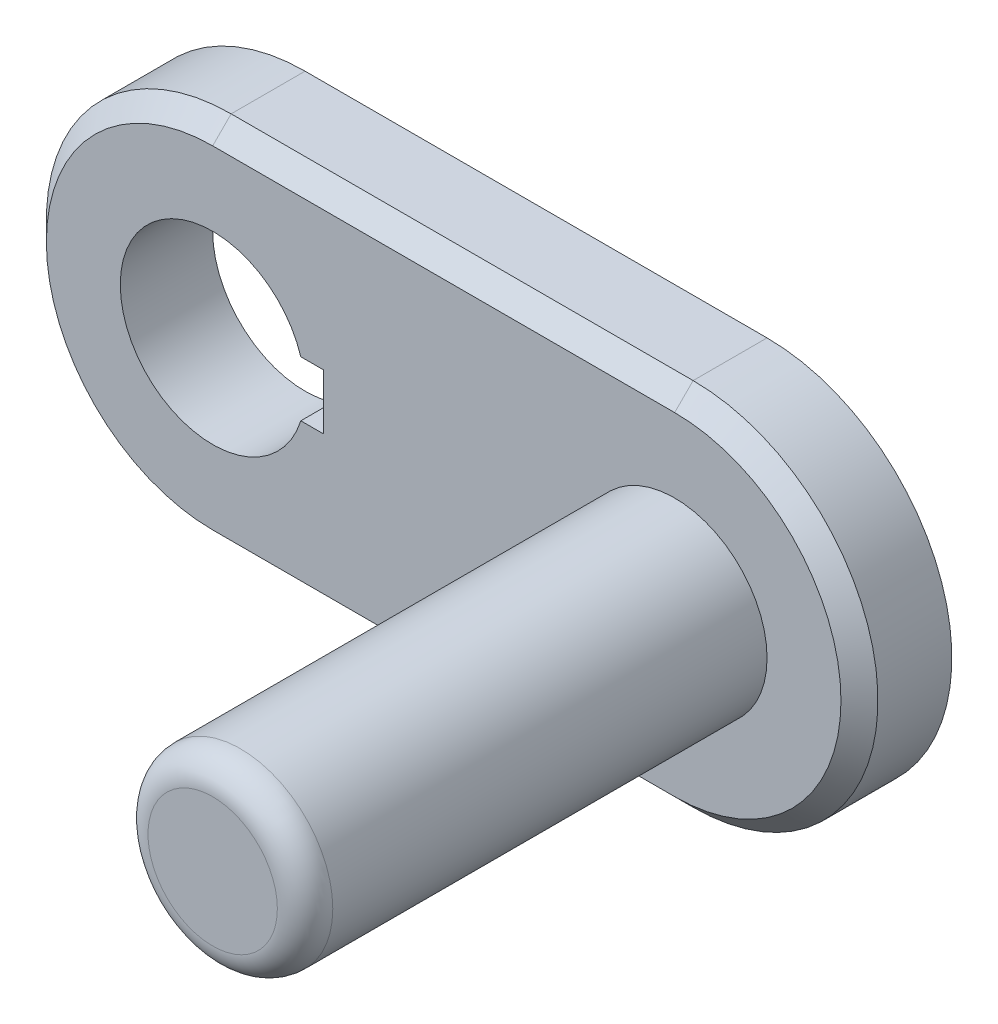
ISO-10303-21;
HEADER;
FILE_DESCRIPTION(('STEP AP214'),'2;1');
FILE_NAME('part.step','',(''),(''),'','','');
FILE_SCHEMA(('AUTOMOTIVE_DESIGN { 1 0 10303 214 1 1 1 1 }'));
ENDSEC;
DATA;
#1=APPLICATION_CONTEXT('core data for automotive mechanical design processes');
#2=APPLICATION_PROTOCOL_DEFINITION('international standard','automotive_design',2000,#1);
#3=PRODUCT_CONTEXT('',#1,'mechanical');
#4=PRODUCT('Part','Part','',(#3));
#5=PRODUCT_RELATED_PRODUCT_CATEGORY('part','',(#4));
#6=PRODUCT_DEFINITION_FORMATION('','',#4);
#7=PRODUCT_DEFINITION_CONTEXT('part definition',#1,'design');
#8=PRODUCT_DEFINITION('design','',#6,#7);
#9=PRODUCT_DEFINITION_SHAPE('','',#8);
#10=(LENGTH_UNIT() NAMED_UNIT(*) SI_UNIT(.MILLI.,.METRE.));
#11=(NAMED_UNIT(*) PLANE_ANGLE_UNIT() SI_UNIT($,.RADIAN.));
#12=(NAMED_UNIT(*) SI_UNIT($,.STERADIAN.) SOLID_ANGLE_UNIT());
#13=UNCERTAINTY_MEASURE_WITH_UNIT(LENGTH_MEASURE(1.E-05),#10,'distance_accuracy_value','');
#14=(GEOMETRIC_REPRESENTATION_CONTEXT(3) GLOBAL_UNCERTAINTY_ASSIGNED_CONTEXT((#13)) GLOBAL_UNIT_ASSIGNED_CONTEXT((#10,
#11,#12)) REPRESENTATION_CONTEXT('',''));
#15=CARTESIAN_POINT('',(0.,0.,0.));
#16=DIRECTION('',(0.,0.,1.));
#17=DIRECTION('',(1.,0.,0.));
#18=AXIS2_PLACEMENT_3D('',#15,#16,#17);
#19=CARTESIAN_POINT('',(0.,0.,10.));
#20=DIRECTION('',(0.,0.,1.));
#21=DIRECTION('',(1.,0.,0.));
#22=AXIS2_PLACEMENT_3D('',#19,#20,#21);
#23=PLANE('',#22);
#24=DIRECTION('',(1.,0.,0.));
#25=VECTOR('',#24,1.);
#26=CARTESIAN_POINT('',(50.,-18.,10.));
#27=LINE('',#26,#25);
#28=CARTESIAN_POINT('',(0.,-18.,10.));
#29=VERTEX_POINT('',#28);
#30=CARTESIAN_POINT('',(50.,-18.,10.));
#31=VERTEX_POINT('',#30);
#32=EDGE_CURVE('E181',#29,#31,#27,.T.);
#33=ORIENTED_EDGE('',*,*,#32,.T.);
#34=CARTESIAN_POINT('',(50.,0.,10.));
#35=DIRECTION('',(0.,0.,1.));
#36=DIRECTION('',(1.,0.,0.));
#37=AXIS2_PLACEMENT_3D('',#34,#35,#36);
#38=CIRCLE('',#37,18.);
#39=CARTESIAN_POINT('',(50.,18.,10.));
#40=VERTEX_POINT('',#39);
#41=EDGE_CURVE('E187',#31,#40,#38,.T.);
#42=ORIENTED_EDGE('',*,*,#41,.T.);
#43=DIRECTION('',(-1.,0.,0.));
#44=VECTOR('',#43,1.);
#45=CARTESIAN_POINT('',(0.,18.,10.));
#46=LINE('',#45,#44);
#47=CARTESIAN_POINT('',(0.,18.,10.));
#48=VERTEX_POINT('',#47);
#49=EDGE_CURVE('E185',#40,#48,#46,.T.);
#50=ORIENTED_EDGE('',*,*,#49,.T.);
#51=CARTESIAN_POINT('',(0.,0.,10.));
#52=DIRECTION('',(0.,0.,1.));
#53=DIRECTION('',(1.,0.,0.));
#54=AXIS2_PLACEMENT_3D('',#51,#52,#53);
#55=CIRCLE('',#54,18.);
#56=EDGE_CURVE('E183',#48,#29,#55,.T.);
#57=ORIENTED_EDGE('',*,*,#56,.T.);
#58=EDGE_LOOP('',(#33,#42,#50,#57));
#59=FACE_BOUND('',#58,.T.);
#60=CARTESIAN_POINT('',(50.,0.,10.));
#61=DIRECTION('',(0.,0.,1.));
#62=DIRECTION('',(1.,0.,0.));
#63=AXIS2_PLACEMENT_3D('',#60,#61,#62);
#64=CIRCLE('',#63,10.);
#65=CARTESIAN_POINT('',(60.,0.,10.));
#66=VERTEX_POINT('',#65);
#67=EDGE_CURVE('E145',#66,#66,#64,.T.);
#68=ORIENTED_EDGE('',*,*,#67,.F.);
#69=EDGE_LOOP('',(#68));
#70=FACE_BOUND('',#69,.T.);
#71=DIRECTION('',(1.,0.,0.));
#72=VECTOR('',#71,1.);
#73=CARTESIAN_POINT('',(9.53939201416946,-3.,10.));
#74=LINE('',#73,#72);
#75=CARTESIAN_POINT('',(9.53939201416946,-3.,10.));
#76=VERTEX_POINT('',#75);
#77=CARTESIAN_POINT('',(12.,-3.,10.));
#78=VERTEX_POINT('',#77);
#79=EDGE_CURVE('E123',#76,#78,#74,.T.);
#80=ORIENTED_EDGE('',*,*,#79,.F.);
#81=CARTESIAN_POINT('',(0.,0.,10.));
#82=DIRECTION('',(0.,0.,1.));
#83=DIRECTION('',(1.,0.,0.));
#84=AXIS2_PLACEMENT_3D('',#81,#82,#83);
#85=CIRCLE('',#84,10.);
#86=CARTESIAN_POINT('',(9.53939201416946,3.,10.));
#87=VERTEX_POINT('',#86);
#88=EDGE_CURVE('E113',#87,#76,#85,.T.);
#89=ORIENTED_EDGE('',*,*,#88,.F.);
#90=DIRECTION('',(-1.,0.,0.));
#91=VECTOR('',#90,1.);
#92=CARTESIAN_POINT('',(9.53939201416946,3.,10.));
#93=LINE('',#92,#91);
#94=CARTESIAN_POINT('',(12.,3.,10.));
#95=VERTEX_POINT('',#94);
#96=EDGE_CURVE('E138',#95,#87,#93,.T.);
#97=ORIENTED_EDGE('',*,*,#96,.F.);
#98=DIRECTION('',(0.,1.,0.));
#99=VECTOR('',#98,1.);
#100=CARTESIAN_POINT('',(12.,3.,10.));
#101=LINE('',#100,#99);
#102=EDGE_CURVE('E136',#78,#95,#101,.T.);
#103=ORIENTED_EDGE('',*,*,#102,.F.);
#104=EDGE_LOOP('',(#80,#89,#97,#103));
#105=FACE_BOUND('',#104,.T.);
#106=ADVANCED_FACE('F35',(#59,#70,#105),#23,.T.);
#107=CARTESIAN_POINT('',(0.,0.,0.));
#108=DIRECTION('',(0.,0.,1.));
#109=DIRECTION('',(1.,0.,0.));
#110=AXIS2_PLACEMENT_3D('',#107,#108,#109);
#111=PLANE('',#110);
#112=CARTESIAN_POINT('',(0.,0.,0.));
#113=DIRECTION('',(0.,0.,1.));
#114=DIRECTION('',(1.,0.,0.));
#115=AXIS2_PLACEMENT_3D('',#112,#113,#114);
#116=CIRCLE('',#115,20.);
#117=CARTESIAN_POINT('',(0.,20.,0.));
#118=VERTEX_POINT('',#117);
#119=CARTESIAN_POINT('',(0.,-20.,0.));
#120=VERTEX_POINT('',#119);
#121=EDGE_CURVE('E131',#118,#120,#116,.T.);
#122=ORIENTED_EDGE('',*,*,#121,.F.);
#123=DIRECTION('',(-1.,0.,0.));
#124=VECTOR('',#123,1.);
#125=CARTESIAN_POINT('',(0.,20.,0.));
#126=LINE('',#125,#124);
#127=CARTESIAN_POINT('',(50.,20.,0.));
#128=VERTEX_POINT('',#127);
#129=EDGE_CURVE('E164',#128,#118,#126,.T.);
#130=ORIENTED_EDGE('',*,*,#129,.F.);
#131=CARTESIAN_POINT('',(50.,0.,0.));
#132=DIRECTION('',(0.,0.,1.));
#133=DIRECTION('',(1.,0.,0.));
#134=AXIS2_PLACEMENT_3D('',#131,#132,#133);
#135=CIRCLE('',#134,20.);
#136=CARTESIAN_POINT('',(50.,-20.,0.));
#137=VERTEX_POINT('',#136);
#138=EDGE_CURVE('E161',#137,#128,#135,.T.);
#139=ORIENTED_EDGE('',*,*,#138,.F.);
#140=DIRECTION('',(1.,0.,0.));
#141=VECTOR('',#140,1.);
#142=CARTESIAN_POINT('',(0.,-20.,0.));
#143=LINE('',#142,#141);
#144=EDGE_CURVE('E158',#120,#137,#143,.T.);
#145=ORIENTED_EDGE('',*,*,#144,.F.);
#146=EDGE_LOOP('',(#122,#130,#139,#145));
#147=FACE_BOUND('',#146,.T.);
#148=CARTESIAN_POINT('',(0.,0.,0.));
#149=DIRECTION('',(0.,0.,1.));
#150=DIRECTION('',(1.,0.,0.));
#151=AXIS2_PLACEMENT_3D('',#148,#149,#150);
#152=CIRCLE('',#151,10.);
#153=CARTESIAN_POINT('',(9.53939201416946,3.,0.));
#154=VERTEX_POINT('',#153);
#155=CARTESIAN_POINT('',(9.53939201416946,-3.,0.));
#156=VERTEX_POINT('',#155);
#157=EDGE_CURVE('E143',#154,#156,#152,.T.);
#158=ORIENTED_EDGE('',*,*,#157,.T.);
#159=DIRECTION('',(1.,0.,0.));
#160=VECTOR('',#159,1.);
#161=CARTESIAN_POINT('',(9.53939201416946,-3.,0.));
#162=LINE('',#161,#160);
#163=CARTESIAN_POINT('',(12.,-3.,0.));
#164=VERTEX_POINT('',#163);
#165=EDGE_CURVE('E130',#156,#164,#162,.T.);
#166=ORIENTED_EDGE('',*,*,#165,.T.);
#167=DIRECTION('',(0.,1.,0.));
#168=VECTOR('',#167,1.);
#169=CARTESIAN_POINT('',(12.,3.,0.));
#170=LINE('',#169,#168);
#171=CARTESIAN_POINT('',(12.,3.,0.));
#172=VERTEX_POINT('',#171);
#173=EDGE_CURVE('E147',#164,#172,#170,.T.);
#174=ORIENTED_EDGE('',*,*,#173,.T.);
#175=DIRECTION('',(-1.,0.,0.));
#176=VECTOR('',#175,1.);
#177=CARTESIAN_POINT('',(9.53939201416946,3.,0.));
#178=LINE('',#177,#176);
#179=EDGE_CURVE('E124',#172,#154,#178,.T.);
#180=ORIENTED_EDGE('',*,*,#179,.T.);
#181=EDGE_LOOP('',(#158,#166,#174,#180));
#182=FACE_BOUND('',#181,.T.);
#183=ADVANCED_FACE('F215',(#147,#182),#111,.F.);
#184=CARTESIAN_POINT('',(0.,0.,10.));
#185=DIRECTION('',(0.,0.,-1.));
#186=DIRECTION('',(-1.,0.,0.));
#187=AXIS2_PLACEMENT_3D('',#184,#185,#186);
#188=CYLINDRICAL_SURFACE('',#187,20.);
#189=DIRECTION('',(0.,0.,-1.));
#190=VECTOR('',#189,1.);
#191=CARTESIAN_POINT('',(0.,-20.,10.));
#192=LINE('',#191,#190);
#193=CARTESIAN_POINT('',(0.,-20.,7.99999999999998));
#194=VERTEX_POINT('',#193);
#195=EDGE_CURVE('E173',#194,#120,#192,.T.);
#196=ORIENTED_EDGE('',*,*,#195,.F.);
#197=CARTESIAN_POINT('',(0.,0.,7.99999999999998));
#198=DIRECTION('',(0.,0.,1.));
#199=DIRECTION('',(1.,0.,0.));
#200=AXIS2_PLACEMENT_3D('',#197,#198,#199);
#201=CIRCLE('',#200,20.);
#202=CARTESIAN_POINT('',(0.,20.,7.99999999999998));
#203=VERTEX_POINT('',#202);
#204=EDGE_CURVE('E44',#194,#203,#201,.F.);
#205=ORIENTED_EDGE('',*,*,#204,.T.);
#206=DIRECTION('',(0.,0.,-1.));
#207=VECTOR('',#206,1.);
#208=CARTESIAN_POINT('',(0.,20.,10.));
#209=LINE('',#208,#207);
#210=EDGE_CURVE('E167',#203,#118,#209,.T.);
#211=ORIENTED_EDGE('',*,*,#210,.T.);
#212=ORIENTED_EDGE('',*,*,#121,.T.);
#213=EDGE_LOOP('',(#196,#205,#211,#212));
#214=FACE_BOUND('',#213,.T.);
#215=ADVANCED_FACE('F221',(#214),#188,.T.);
#216=CARTESIAN_POINT('',(0.,-20.,10.));
#217=DIRECTION('',(0.,1.,0.));
#218=DIRECTION('',(0.,0.,1.));
#219=AXIS2_PLACEMENT_3D('',#216,#217,#218);
#220=PLANE('',#219);
#221=DIRECTION('',(0.,0.,-1.));
#222=VECTOR('',#221,1.);
#223=CARTESIAN_POINT('',(50.,-20.,10.));
#224=LINE('',#223,#222);
#225=CARTESIAN_POINT('',(50.,-20.,7.99999999999998));
#226=VERTEX_POINT('',#225);
#227=EDGE_CURVE('E171',#226,#137,#224,.T.);
#228=ORIENTED_EDGE('',*,*,#227,.F.);
#229=DIRECTION('',(-1.,0.,0.));
#230=VECTOR('',#229,1.);
#231=CARTESIAN_POINT('',(0.,-20.,7.99999999999998));
#232=LINE('',#231,#230);
#233=EDGE_CURVE('E11',#226,#194,#232,.T.);
#234=ORIENTED_EDGE('',*,*,#233,.T.);
#235=ORIENTED_EDGE('',*,*,#195,.T.);
#236=ORIENTED_EDGE('',*,*,#144,.T.);
#237=EDGE_LOOP('',(#228,#234,#235,#236));
#238=FACE_BOUND('',#237,.T.);
#239=ADVANCED_FACE('F234',(#238),#220,.F.);
#240=CARTESIAN_POINT('',(50.,0.,10.));
#241=DIRECTION('',(0.,0.,-1.));
#242=DIRECTION('',(-1.,0.,0.));
#243=AXIS2_PLACEMENT_3D('',#240,#241,#242);
#244=CYLINDRICAL_SURFACE('',#243,20.);
#245=DIRECTION('',(0.,0.,-1.));
#246=VECTOR('',#245,1.);
#247=CARTESIAN_POINT('',(50.,20.,10.));
#248=LINE('',#247,#246);
#249=CARTESIAN_POINT('',(50.,20.,7.99999999999998));
#250=VERTEX_POINT('',#249);
#251=EDGE_CURVE('E169',#250,#128,#248,.T.);
#252=ORIENTED_EDGE('',*,*,#251,.F.);
#253=CARTESIAN_POINT('',(50.,0.,7.99999999999998));
#254=DIRECTION('',(0.,0.,1.));
#255=DIRECTION('',(1.,0.,0.));
#256=AXIS2_PLACEMENT_3D('',#253,#254,#255);
#257=CIRCLE('',#256,20.);
#258=EDGE_CURVE('E190',#250,#226,#257,.F.);
#259=ORIENTED_EDGE('',*,*,#258,.T.);
#260=ORIENTED_EDGE('',*,*,#227,.T.);
#261=ORIENTED_EDGE('',*,*,#138,.T.);
#262=EDGE_LOOP('',(#252,#259,#260,#261));
#263=FACE_BOUND('',#262,.T.);
#264=ADVANCED_FACE('F230',(#263),#244,.T.);
#265=CARTESIAN_POINT('',(0.,20.,10.));
#266=DIRECTION('',(0.,-1.,0.));
#267=DIRECTION('',(0.,0.,-1.));
#268=AXIS2_PLACEMENT_3D('',#265,#266,#267);
#269=PLANE('',#268);
#270=ORIENTED_EDGE('',*,*,#210,.F.);
#271=DIRECTION('',(1.,0.,0.));
#272=VECTOR('',#271,1.);
#273=CARTESIAN_POINT('',(50.,20.,7.99999999999998));
#274=LINE('',#273,#272);
#275=EDGE_CURVE('E193',#203,#250,#274,.T.);
#276=ORIENTED_EDGE('',*,*,#275,.T.);
#277=ORIENTED_EDGE('',*,*,#251,.T.);
#278=ORIENTED_EDGE('',*,*,#129,.T.);
#279=EDGE_LOOP('',(#270,#276,#277,#278));
#280=FACE_BOUND('',#279,.T.);
#281=ADVANCED_FACE('F227',(#280),#269,.F.);
#282=CARTESIAN_POINT('',(0.,0.,10.));
#283=DIRECTION('',(0.,0.,-1.));
#284=DIRECTION('',(-1.,0.,0.));
#285=AXIS2_PLACEMENT_3D('',#282,#283,#284);
#286=CYLINDRICAL_SURFACE('',#285,10.);
#287=ORIENTED_EDGE('',*,*,#157,.F.);
#288=DIRECTION('',(0.,0.,-1.));
#289=VECTOR('',#288,1.);
#290=CARTESIAN_POINT('',(9.53939201416946,3.,10.));
#291=LINE('',#290,#289);
#292=EDGE_CURVE('E119',#87,#154,#291,.T.);
#293=ORIENTED_EDGE('',*,*,#292,.F.);
#294=ORIENTED_EDGE('',*,*,#88,.T.);
#295=DIRECTION('',(0.,0.,-1.));
#296=VECTOR('',#295,1.);
#297=CARTESIAN_POINT('',(9.53939201416946,-3.,10.));
#298=LINE('',#297,#296);
#299=EDGE_CURVE('E116',#76,#156,#298,.T.);
#300=ORIENTED_EDGE('',*,*,#299,.T.);
#301=EDGE_LOOP('',(#287,#293,#294,#300));
#302=FACE_BOUND('',#301,.T.);
#303=ADVANCED_FACE('F115',(#302),#286,.F.);
#304=CARTESIAN_POINT('',(9.53939201416946,-3.,10.));
#305=DIRECTION('',(0.,1.,0.));
#306=DIRECTION('',(0.,0.,1.));
#307=AXIS2_PLACEMENT_3D('',#304,#305,#306);
#308=PLANE('',#307);
#309=ORIENTED_EDGE('',*,*,#165,.F.);
#310=ORIENTED_EDGE('',*,*,#299,.F.);
#311=ORIENTED_EDGE('',*,*,#79,.T.);
#312=DIRECTION('',(0.,0.,-1.));
#313=VECTOR('',#312,1.);
#314=CARTESIAN_POINT('',(12.,-3.,10.));
#315=LINE('',#314,#313);
#316=EDGE_CURVE('E132',#78,#164,#315,.T.);
#317=ORIENTED_EDGE('',*,*,#316,.T.);
#318=EDGE_LOOP('',(#309,#310,#311,#317));
#319=FACE_BOUND('',#318,.T.);
#320=ADVANCED_FACE('F127',(#319),#308,.T.);
#321=CARTESIAN_POINT('',(12.,3.,10.));
#322=DIRECTION('',(-1.,0.,0.));
#323=DIRECTION('',(0.,0.,1.));
#324=AXIS2_PLACEMENT_3D('',#321,#322,#323);
#325=PLANE('',#324);
#326=ORIENTED_EDGE('',*,*,#173,.F.);
#327=ORIENTED_EDGE('',*,*,#316,.F.);
#328=ORIENTED_EDGE('',*,*,#102,.T.);
#329=DIRECTION('',(0.,0.,-1.));
#330=VECTOR('',#329,1.);
#331=CARTESIAN_POINT('',(12.,3.,10.));
#332=LINE('',#331,#330);
#333=EDGE_CURVE('E153',#95,#172,#332,.T.);
#334=ORIENTED_EDGE('',*,*,#333,.T.);
#335=EDGE_LOOP('',(#326,#327,#328,#334));
#336=FACE_BOUND('',#335,.T.);
#337=ADVANCED_FACE('F275',(#336),#325,.T.);
#338=CARTESIAN_POINT('',(9.53939201416946,3.,10.));
#339=DIRECTION('',(0.,-1.,0.));
#340=DIRECTION('',(0.,0.,-1.));
#341=AXIS2_PLACEMENT_3D('',#338,#339,#340);
#342=PLANE('',#341);
#343=ORIENTED_EDGE('',*,*,#179,.F.);
#344=ORIENTED_EDGE('',*,*,#333,.F.);
#345=ORIENTED_EDGE('',*,*,#96,.T.);
#346=ORIENTED_EDGE('',*,*,#292,.T.);
#347=EDGE_LOOP('',(#343,#344,#345,#346));
#348=FACE_BOUND('',#347,.T.);
#349=ADVANCED_FACE('F272',(#348),#342,.T.);
#350=CARTESIAN_POINT('',(50.,0.,60.));
#351=DIRECTION('',(0.,0.,-1.));
#352=DIRECTION('',(-1.,0.,0.));
#353=AXIS2_PLACEMENT_3D('',#350,#351,#352);
#354=CYLINDRICAL_SURFACE('',#353,10.);
#355=CARTESIAN_POINT('',(50.,0.,57.));
#356=DIRECTION('',(0.,0.,1.));
#357=DIRECTION('',(1.,0.,0.));
#358=AXIS2_PLACEMENT_3D('',#355,#356,#357);
#359=CIRCLE('',#358,10.);
#360=CARTESIAN_POINT('',(60.,0.,57.));
#361=VERTEX_POINT('',#360);
#362=EDGE_CURVE('E178',#361,#361,#359,.F.);
#363=ORIENTED_EDGE('',*,*,#362,.T.);
#364=EDGE_LOOP('',(#363));
#365=FACE_BOUND('',#364,.T.);
#366=ORIENTED_EDGE('',*,*,#67,.T.);
#367=EDGE_LOOP('',(#366));
#368=FACE_BOUND('',#367,.T.);
#369=ADVANCED_FACE('F212',(#365,#368),#354,.T.);
#370=CARTESIAN_POINT('',(50.,0.,60.));
#371=DIRECTION('',(0.,0.,1.));
#372=DIRECTION('',(1.,0.,0.));
#373=AXIS2_PLACEMENT_3D('',#370,#371,#372);
#374=PLANE('',#373);
#375=CARTESIAN_POINT('',(50.,0.,60.));
#376=DIRECTION('',(0.,0.,1.));
#377=DIRECTION('',(1.,0.,0.));
#378=AXIS2_PLACEMENT_3D('',#375,#376,#377);
#379=CIRCLE('',#378,7.);
#380=CARTESIAN_POINT('',(57.,0.,60.));
#381=VERTEX_POINT('',#380);
#382=EDGE_CURVE('E175',#381,#381,#379,.T.);
#383=ORIENTED_EDGE('',*,*,#382,.T.);
#384=EDGE_LOOP('',(#383));
#385=FACE_BOUND('',#384,.T.);
#386=ADVANCED_FACE('F243',(#385),#374,.T.);
#387=CARTESIAN_POINT('',(50.,0.,57.));
#388=DIRECTION('',(0.,0.,1.));
#389=DIRECTION('',(1.,0.,0.));
#390=AXIS2_PLACEMENT_3D('',#387,#388,#389);
#391=TOROIDAL_SURFACE('',#390,7.,3.);
#392=ORIENTED_EDGE('',*,*,#362,.F.);
#393=EDGE_LOOP('',(#392));
#394=FACE_BOUND('',#393,.T.);
#395=ORIENTED_EDGE('',*,*,#382,.F.);
#396=EDGE_LOOP('',(#395));
#397=FACE_BOUND('',#396,.T.);
#398=ADVANCED_FACE('F240',(#394,#397),#391,.T.);
#399=CARTESIAN_POINT('',(0.,0.,10.));
#400=DIRECTION('',(0.,0.,-1.));
#401=DIRECTION('',(-1.,0.,0.));
#402=AXIS2_PLACEMENT_3D('',#399,#400,#401);
#403=CONICAL_SURFACE('',#402,18.,0.785398163397445);
#404=DIRECTION('',(0.,-0.707106781186545,0.70710678118655));
#405=VECTOR('',#404,1.);
#406=CARTESIAN_POINT('',(0.,20.,7.99999999999998));
#407=LINE('',#406,#405);
#408=EDGE_CURVE('E199',#203,#48,#407,.T.);
#409=ORIENTED_EDGE('',*,*,#408,.F.);
#410=ORIENTED_EDGE('',*,*,#204,.F.);
#411=DIRECTION('',(0.,-0.707106781186545,-0.70710678118655));
#412=VECTOR('',#411,1.);
#413=CARTESIAN_POINT('',(0.,-18.,10.));
#414=LINE('',#413,#412);
#415=EDGE_CURVE('E39',#29,#194,#414,.T.);
#416=ORIENTED_EDGE('',*,*,#415,.F.);
#417=ORIENTED_EDGE('',*,*,#56,.F.);
#418=EDGE_LOOP('',(#409,#410,#416,#417));
#419=FACE_BOUND('',#418,.T.);
#420=ADVANCED_FACE('F37',(#419),#403,.T.);
#421=CARTESIAN_POINT('',(0.,-18.,10.));
#422=DIRECTION('',(0.,-0.70710678118655,0.707106781186545));
#423=DIRECTION('',(-1.,0.,0.));
#424=AXIS2_PLACEMENT_3D('',#421,#422,#423);
#425=PLANE('',#424);
#426=ORIENTED_EDGE('',*,*,#415,.T.);
#427=ORIENTED_EDGE('',*,*,#233,.F.);
#428=DIRECTION('',(0.,-0.707106781186545,-0.70710678118655));
#429=VECTOR('',#428,1.);
#430=CARTESIAN_POINT('',(50.,-18.,10.));
#431=LINE('',#430,#429);
#432=EDGE_CURVE('E198',#31,#226,#431,.T.);
#433=ORIENTED_EDGE('',*,*,#432,.F.);
#434=ORIENTED_EDGE('',*,*,#32,.F.);
#435=EDGE_LOOP('',(#426,#427,#433,#434));
#436=FACE_BOUND('',#435,.T.);
#437=ADVANCED_FACE('F251',(#436),#425,.T.);
#438=CARTESIAN_POINT('',(0.,18.,10.));
#439=DIRECTION('',(0.,0.70710678118655,0.707106781186545));
#440=DIRECTION('',(1.,0.,0.));
#441=AXIS2_PLACEMENT_3D('',#438,#439,#440);
#442=PLANE('',#441);
#443=ORIENTED_EDGE('',*,*,#408,.T.);
#444=ORIENTED_EDGE('',*,*,#49,.F.);
#445=DIRECTION('',(0.,-0.707106781186545,0.70710678118655));
#446=VECTOR('',#445,1.);
#447=CARTESIAN_POINT('',(50.,20.,7.99999999999998));
#448=LINE('',#447,#446);
#449=EDGE_CURVE('E196',#250,#40,#448,.T.);
#450=ORIENTED_EDGE('',*,*,#449,.F.);
#451=ORIENTED_EDGE('',*,*,#275,.F.);
#452=EDGE_LOOP('',(#443,#444,#450,#451));
#453=FACE_BOUND('',#452,.T.);
#454=ADVANCED_FACE('F248',(#453),#442,.T.);
#455=CARTESIAN_POINT('',(50.,0.,10.));
#456=DIRECTION('',(0.,0.,-1.));
#457=DIRECTION('',(-1.,0.,0.));
#458=AXIS2_PLACEMENT_3D('',#455,#456,#457);
#459=CONICAL_SURFACE('',#458,18.,0.785398163397445);
#460=ORIENTED_EDGE('',*,*,#432,.T.);
#461=ORIENTED_EDGE('',*,*,#258,.F.);
#462=ORIENTED_EDGE('',*,*,#449,.T.);
#463=ORIENTED_EDGE('',*,*,#41,.F.);
#464=EDGE_LOOP('',(#460,#461,#462,#463));
#465=FACE_BOUND('',#464,.T.);
#466=ADVANCED_FACE('F245',(#465),#459,.T.);
#467=CLOSED_SHELL('',(#106,#183,#215,#239,#264,#281,#303,#320,#337,#349,#369,#386,#398,#420,
#437,#454,#466));
#468=MANIFOLD_SOLID_BREP('B2',#467);
#469=ADVANCED_BREP_SHAPE_REPRESENTATION('',(#18,#468),#14);
#470=SHAPE_DEFINITION_REPRESENTATION(#9,#469);
ENDSEC;
END-ISO-10303-21;
